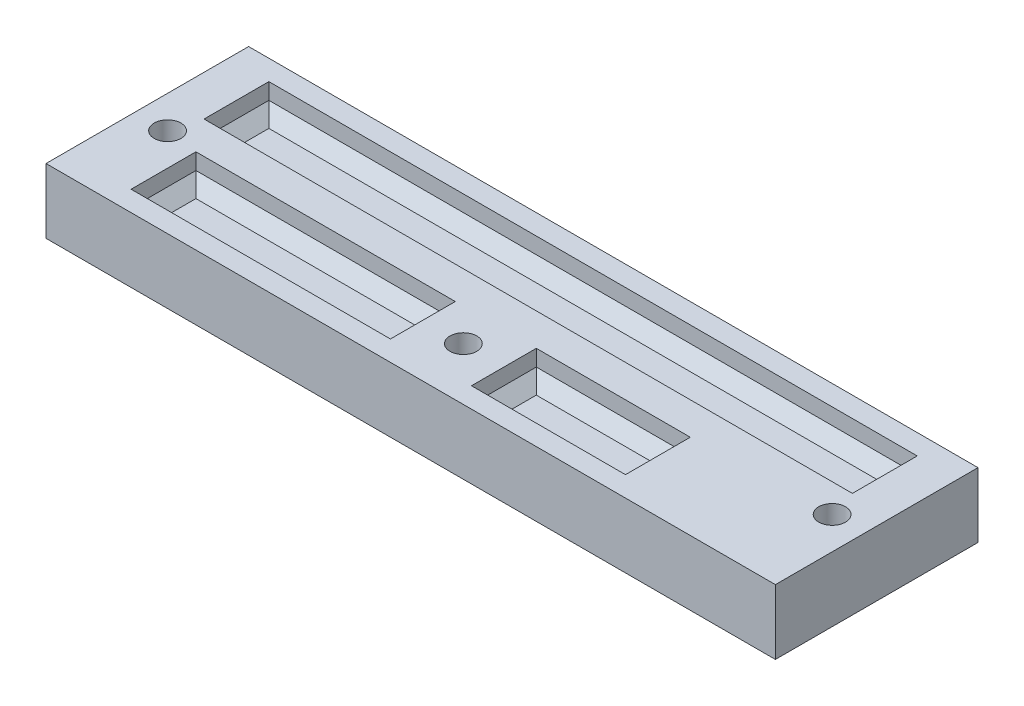
ISO-10303-21;
HEADER;
FILE_DESCRIPTION(('STEP AP214'),'2;1');
FILE_NAME('part.step','',(''),(''),'','','');
FILE_SCHEMA(('AUTOMOTIVE_DESIGN { 1 0 10303 214 1 1 1 1 }'));
ENDSEC;
DATA;
#1=APPLICATION_CONTEXT('core data for automotive mechanical design processes');
#2=APPLICATION_PROTOCOL_DEFINITION('international standard','automotive_design',2000,#1);
#3=PRODUCT_CONTEXT('',#1,'mechanical');
#4=PRODUCT('Part','Part','',(#3));
#5=PRODUCT_RELATED_PRODUCT_CATEGORY('part','',(#4));
#6=PRODUCT_DEFINITION_FORMATION('','',#4);
#7=PRODUCT_DEFINITION_CONTEXT('part definition',#1,'design');
#8=PRODUCT_DEFINITION('design','',#6,#7);
#9=PRODUCT_DEFINITION_SHAPE('','',#8);
#10=(LENGTH_UNIT() NAMED_UNIT(*) SI_UNIT(.MILLI.,.METRE.));
#11=(NAMED_UNIT(*) PLANE_ANGLE_UNIT() SI_UNIT($,.RADIAN.));
#12=(NAMED_UNIT(*) SI_UNIT($,.STERADIAN.) SOLID_ANGLE_UNIT());
#13=UNCERTAINTY_MEASURE_WITH_UNIT(LENGTH_MEASURE(1.E-05),#10,'distance_accuracy_value','');
#14=(GEOMETRIC_REPRESENTATION_CONTEXT(3) GLOBAL_UNCERTAINTY_ASSIGNED_CONTEXT((#13)) GLOBAL_UNIT_ASSIGNED_CONTEXT((#10,
#11,#12)) REPRESENTATION_CONTEXT('',''));
#15=CARTESIAN_POINT('',(0.,0.,0.));
#16=DIRECTION('',(0.,0.,1.));
#17=DIRECTION('',(1.,0.,0.));
#18=AXIS2_PLACEMENT_3D('',#15,#16,#17);
#19=CARTESIAN_POINT('',(0.,8.,0.));
#20=DIRECTION('',(0.,-1.,0.));
#21=DIRECTION('',(0.,0.,-1.));
#22=AXIS2_PLACEMENT_3D('',#19,#20,#21);
#23=PLANE('',#22);
#24=DIRECTION('',(0.,0.,-1.));
#25=VECTOR('',#24,1.);
#26=CARTESIAN_POINT('',(45.,8.,12.5));
#27=LINE('',#26,#25);
#28=CARTESIAN_POINT('',(45.,8.,12.5));
#29=VERTEX_POINT('',#28);
#30=CARTESIAN_POINT('',(45.,8.,-12.5));
#31=VERTEX_POINT('',#30);
#32=EDGE_CURVE('E366',#29,#31,#27,.T.);
#33=ORIENTED_EDGE('',*,*,#32,.T.);
#34=DIRECTION('',(-1.,0.,0.));
#35=VECTOR('',#34,1.);
#36=CARTESIAN_POINT('',(-45.,8.,-12.5));
#37=LINE('',#36,#35);
#38=CARTESIAN_POINT('',(-45.,8.,-12.5));
#39=VERTEX_POINT('',#38);
#40=EDGE_CURVE('E369',#31,#39,#37,.T.);
#41=ORIENTED_EDGE('',*,*,#40,.T.);
#42=DIRECTION('',(0.,0.,1.));
#43=VECTOR('',#42,1.);
#44=CARTESIAN_POINT('',(-45.,8.,12.5));
#45=LINE('',#44,#43);
#46=CARTESIAN_POINT('',(-45.,8.,12.5));
#47=VERTEX_POINT('',#46);
#48=EDGE_CURVE('E372',#39,#47,#45,.T.);
#49=ORIENTED_EDGE('',*,*,#48,.T.);
#50=DIRECTION('',(1.,0.,0.));
#51=VECTOR('',#50,1.);
#52=CARTESIAN_POINT('',(-45.,8.,12.5));
#53=LINE('',#52,#51);
#54=EDGE_CURVE('E374',#47,#29,#53,.T.);
#55=ORIENTED_EDGE('',*,*,#54,.T.);
#56=EDGE_LOOP('',(#33,#41,#49,#55));
#57=FACE_BOUND('',#56,.T.);
#58=CARTESIAN_POINT('',(-41.,8.,1.5));
#59=DIRECTION('',(0.,1.,0.));
#60=DIRECTION('',(0.,0.,1.));
#61=AXIS2_PLACEMENT_3D('',#58,#59,#60);
#62=CIRCLE('',#61,1.65);
#63=CARTESIAN_POINT('',(-41.,8.,3.15));
#64=VERTEX_POINT('',#63);
#65=EDGE_CURVE('E363',#64,#64,#62,.T.);
#66=ORIENTED_EDGE('',*,*,#65,.F.);
#67=EDGE_LOOP('',(#66));
#68=FACE_BOUND('',#67,.T.);
#69=CARTESIAN_POINT('',(41.,8.,1.50000000000003));
#70=DIRECTION('',(0.,1.,0.));
#71=DIRECTION('',(0.,0.,1.));
#72=AXIS2_PLACEMENT_3D('',#69,#70,#71);
#73=CIRCLE('',#72,1.65000000000002);
#74=CARTESIAN_POINT('',(41.,8.,3.15000000000005));
#75=VERTEX_POINT('',#74);
#76=EDGE_CURVE('E360',#75,#75,#73,.T.);
#77=ORIENTED_EDGE('',*,*,#76,.F.);
#78=EDGE_LOOP('',(#77));
#79=FACE_BOUND('',#78,.T.);
#80=CARTESIAN_POINT('',(0.,8.,5.99999999999998));
#81=DIRECTION('',(0.,1.,0.));
#82=DIRECTION('',(0.,0.,1.));
#83=AXIS2_PLACEMENT_3D('',#80,#81,#82);
#84=CIRCLE('',#83,1.65);
#85=CARTESIAN_POINT('',(0.,8.,7.64999999999998));
#86=VERTEX_POINT('',#85);
#87=EDGE_CURVE('E356',#86,#86,#84,.T.);
#88=ORIENTED_EDGE('',*,*,#87,.F.);
#89=EDGE_LOOP('',(#88));
#90=FACE_BOUND('',#89,.T.);
#91=DIRECTION('',(1.,0.,0.));
#92=VECTOR('',#91,1.);
#93=CARTESIAN_POINT('',(5.,8.,10.));
#94=LINE('',#93,#92);
#95=CARTESIAN_POINT('',(5.,8.,10.));
#96=VERTEX_POINT('',#95);
#97=CARTESIAN_POINT('',(24.,8.,10.));
#98=VERTEX_POINT('',#97);
#99=EDGE_CURVE('E305',#96,#98,#94,.T.);
#100=ORIENTED_EDGE('',*,*,#99,.F.);
#101=DIRECTION('',(0.,0.,-1.));
#102=VECTOR('',#101,1.);
#103=CARTESIAN_POINT('',(5.,8.,1.99999999999999));
#104=LINE('',#103,#102);
#105=CARTESIAN_POINT('',(5.,8.,1.99999999999999));
#106=VERTEX_POINT('',#105);
#107=EDGE_CURVE('E296',#96,#106,#104,.T.);
#108=ORIENTED_EDGE('',*,*,#107,.T.);
#109=DIRECTION('',(1.,0.,0.));
#110=VECTOR('',#109,1.);
#111=CARTESIAN_POINT('',(5.,8.,1.99999999999999));
#112=LINE('',#111,#110);
#113=CARTESIAN_POINT('',(24.,8.,1.99999999999999));
#114=VERTEX_POINT('',#113);
#115=EDGE_CURVE('E298',#106,#114,#112,.T.);
#116=ORIENTED_EDGE('',*,*,#115,.T.);
#117=DIRECTION('',(0.,0.,-1.));
#118=VECTOR('',#117,1.);
#119=CARTESIAN_POINT('',(24.,8.,1.99999999999999));
#120=LINE('',#119,#118);
#121=EDGE_CURVE('E294',#98,#114,#120,.T.);
#122=ORIENTED_EDGE('',*,*,#121,.F.);
#123=EDGE_LOOP('',(#100,#108,#116,#122));
#124=FACE_BOUND('',#123,.T.);
#125=DIRECTION('',(-1.,0.,0.));
#126=VECTOR('',#125,1.);
#127=CARTESIAN_POINT('',(-5.,8.,2.));
#128=LINE('',#127,#126);
#129=CARTESIAN_POINT('',(-5.,8.,2.));
#130=VERTEX_POINT('',#129);
#131=CARTESIAN_POINT('',(-37.,8.,2.));
#132=VERTEX_POINT('',#131);
#133=EDGE_CURVE('E66',#130,#132,#128,.T.);
#134=ORIENTED_EDGE('',*,*,#133,.F.);
#135=DIRECTION('',(0.,0.,1.));
#136=VECTOR('',#135,1.);
#137=CARTESIAN_POINT('',(-5.,8.,10.));
#138=LINE('',#137,#136);
#139=CARTESIAN_POINT('',(-5.,8.,10.));
#140=VERTEX_POINT('',#139);
#141=EDGE_CURVE('E840',#130,#140,#138,.T.);
#142=ORIENTED_EDGE('',*,*,#141,.T.);
#143=DIRECTION('',(-1.,0.,0.));
#144=VECTOR('',#143,1.);
#145=CARTESIAN_POINT('',(-5.,8.,10.));
#146=LINE('',#145,#144);
#147=CARTESIAN_POINT('',(-37.,8.,9.99999999999999));
#148=VERTEX_POINT('',#147);
#149=EDGE_CURVE('E219',#140,#148,#146,.T.);
#150=ORIENTED_EDGE('',*,*,#149,.T.);
#151=DIRECTION('',(0.,0.,1.));
#152=VECTOR('',#151,1.);
#153=CARTESIAN_POINT('',(-37.,8.,9.99999999999999));
#154=LINE('',#153,#152);
#155=EDGE_CURVE('E224',#132,#148,#154,.T.);
#156=ORIENTED_EDGE('',*,*,#155,.F.);
#157=EDGE_LOOP('',(#134,#142,#150,#156));
#158=FACE_BOUND('',#157,.T.);
#159=DIRECTION('',(0.,0.,1.));
#160=VECTOR('',#159,1.);
#161=CARTESIAN_POINT('',(-40.,8.,-1.99999999999999));
#162=LINE('',#161,#160);
#163=CARTESIAN_POINT('',(-40.,8.,-9.99999999999999));
#164=VERTEX_POINT('',#163);
#165=CARTESIAN_POINT('',(-40.,8.,-1.99999999999999));
#166=VERTEX_POINT('',#165);
#167=EDGE_CURVE('E251',#164,#166,#162,.T.);
#168=ORIENTED_EDGE('',*,*,#167,.F.);
#169=DIRECTION('',(1.,0.,0.));
#170=VECTOR('',#169,1.);
#171=CARTESIAN_POINT('',(-40.,8.,-9.99999999999999));
#172=LINE('',#171,#170);
#173=CARTESIAN_POINT('',(40.,8.,-9.99999999999999));
#174=VERTEX_POINT('',#173);
#175=EDGE_CURVE('E258',#164,#174,#172,.T.);
#176=ORIENTED_EDGE('',*,*,#175,.T.);
#177=DIRECTION('',(0.,0.,1.));
#178=VECTOR('',#177,1.);
#179=CARTESIAN_POINT('',(40.,8.,-1.99999999999999));
#180=LINE('',#179,#178);
#181=CARTESIAN_POINT('',(40.,8.,-1.99999999999999));
#182=VERTEX_POINT('',#181);
#183=EDGE_CURVE('E242',#174,#182,#180,.T.);
#184=ORIENTED_EDGE('',*,*,#183,.T.);
#185=DIRECTION('',(1.,0.,0.));
#186=VECTOR('',#185,1.);
#187=CARTESIAN_POINT('',(-40.,8.,-1.99999999999999));
#188=LINE('',#187,#186);
#189=EDGE_CURVE('E255',#166,#182,#188,.T.);
#190=ORIENTED_EDGE('',*,*,#189,.F.);
#191=EDGE_LOOP('',(#168,#176,#184,#190));
#192=FACE_BOUND('',#191,.T.);
#193=ADVANCED_FACE('F41',(#57,#68,#79,#90,#124,#158,#192),#23,.F.);
#194=CARTESIAN_POINT('',(-41.,0.,1.5));
#195=DIRECTION('',(0.,1.,0.));
#196=DIRECTION('',(0.,0.,1.));
#197=AXIS2_PLACEMENT_3D('',#194,#195,#196);
#198=CYLINDRICAL_SURFACE('',#197,1.65);
#199=ORIENTED_EDGE('',*,*,#65,.T.);
#200=EDGE_LOOP('',(#199));
#201=FACE_BOUND('',#200,.T.);
#202=CARTESIAN_POINT('',(-41.,4.,1.5));
#203=DIRECTION('',(0.,-1.,0.));
#204=DIRECTION('',(0.,0.,-1.));
#205=AXIS2_PLACEMENT_3D('',#202,#203,#204);
#206=CIRCLE('',#205,1.65);
#207=CARTESIAN_POINT('',(-41.,4.,-0.150000000000002));
#208=VERTEX_POINT('',#207);
#209=EDGE_CURVE('E45',#208,#208,#206,.F.);
#210=ORIENTED_EDGE('',*,*,#209,.F.);
#211=EDGE_LOOP('',(#210));
#212=FACE_BOUND('',#211,.T.);
#213=ADVANCED_FACE('F401',(#201,#212),#198,.F.);
#214=CARTESIAN_POINT('',(41.,0.,1.50000000000003));
#215=DIRECTION('',(0.,1.,0.));
#216=DIRECTION('',(0.,0.,1.));
#217=AXIS2_PLACEMENT_3D('',#214,#215,#216);
#218=CYLINDRICAL_SURFACE('',#217,1.65000000000002);
#219=ORIENTED_EDGE('',*,*,#76,.T.);
#220=EDGE_LOOP('',(#219));
#221=FACE_BOUND('',#220,.T.);
#222=CARTESIAN_POINT('',(41.,4.,1.50000000000003));
#223=DIRECTION('',(0.,-1.,0.));
#224=DIRECTION('',(0.,0.,-1.));
#225=AXIS2_PLACEMENT_3D('',#222,#223,#224);
#226=CIRCLE('',#225,1.65000000000002);
#227=CARTESIAN_POINT('',(41.,4.,-0.149999999999998));
#228=VERTEX_POINT('',#227);
#229=EDGE_CURVE('E392',#228,#228,#226,.F.);
#230=ORIENTED_EDGE('',*,*,#229,.F.);
#231=EDGE_LOOP('',(#230));
#232=FACE_BOUND('',#231,.T.);
#233=ADVANCED_FACE('F403',(#221,#232),#218,.F.);
#234=CARTESIAN_POINT('',(0.,0.,5.99999999999998));
#235=DIRECTION('',(0.,1.,0.));
#236=DIRECTION('',(0.,0.,1.));
#237=AXIS2_PLACEMENT_3D('',#234,#235,#236);
#238=CYLINDRICAL_SURFACE('',#237,1.65);
#239=ORIENTED_EDGE('',*,*,#87,.T.);
#240=EDGE_LOOP('',(#239));
#241=FACE_BOUND('',#240,.T.);
#242=CARTESIAN_POINT('',(0.,4.,5.99999999999998));
#243=DIRECTION('',(0.,-1.,0.));
#244=DIRECTION('',(0.,0.,-1.));
#245=AXIS2_PLACEMENT_3D('',#242,#243,#244);
#246=CIRCLE('',#245,1.65);
#247=CARTESIAN_POINT('',(0.,4.,4.34999999999998));
#248=VERTEX_POINT('',#247);
#249=EDGE_CURVE('E341',#248,#248,#246,.F.);
#250=ORIENTED_EDGE('',*,*,#249,.F.);
#251=EDGE_LOOP('',(#250));
#252=FACE_BOUND('',#251,.T.);
#253=ADVANCED_FACE('F410',(#241,#252),#238,.F.);
#254=CARTESIAN_POINT('',(45.,8.,12.5));
#255=DIRECTION('',(-1.,0.,0.));
#256=DIRECTION('',(0.,0.,1.));
#257=AXIS2_PLACEMENT_3D('',#254,#255,#256);
#258=PLANE('',#257);
#259=DIRECTION('',(0.,0.,-1.));
#260=VECTOR('',#259,1.);
#261=CARTESIAN_POINT('',(45.,0.,12.5));
#262=LINE('',#261,#260);
#263=CARTESIAN_POINT('',(45.,0.,12.5));
#264=VERTEX_POINT('',#263);
#265=CARTESIAN_POINT('',(45.,0.,-12.5));
#266=VERTEX_POINT('',#265);
#267=EDGE_CURVE('E359',#264,#266,#262,.T.);
#268=ORIENTED_EDGE('',*,*,#267,.T.);
#269=DIRECTION('',(0.,-1.,0.));
#270=VECTOR('',#269,1.);
#271=CARTESIAN_POINT('',(45.,8.,-12.5));
#272=LINE('',#271,#270);
#273=EDGE_CURVE('E11',#31,#266,#272,.T.);
#274=ORIENTED_EDGE('',*,*,#273,.F.);
#275=ORIENTED_EDGE('',*,*,#32,.F.);
#276=DIRECTION('',(0.,-1.,0.));
#277=VECTOR('',#276,1.);
#278=CARTESIAN_POINT('',(45.,8.,12.5));
#279=LINE('',#278,#277);
#280=EDGE_CURVE('E376',#29,#264,#279,.T.);
#281=ORIENTED_EDGE('',*,*,#280,.T.);
#282=EDGE_LOOP('',(#268,#274,#275,#281));
#283=FACE_BOUND('',#282,.T.);
#284=ADVANCED_FACE('F43',(#283),#258,.F.);
#285=CARTESIAN_POINT('',(-45.,8.,-12.5));
#286=DIRECTION('',(0.,0.,1.));
#287=DIRECTION('',(1.,0.,0.));
#288=AXIS2_PLACEMENT_3D('',#285,#286,#287);
#289=PLANE('',#288);
#290=DIRECTION('',(-1.,0.,0.));
#291=VECTOR('',#290,1.);
#292=CARTESIAN_POINT('',(-45.,0.,-12.5));
#293=LINE('',#292,#291);
#294=CARTESIAN_POINT('',(-45.,0.,-12.5));
#295=VERTEX_POINT('',#294);
#296=EDGE_CURVE('E379',#266,#295,#293,.T.);
#297=ORIENTED_EDGE('',*,*,#296,.T.);
#298=DIRECTION('',(0.,-1.,0.));
#299=VECTOR('',#298,1.);
#300=CARTESIAN_POINT('',(-45.,8.,-12.5));
#301=LINE('',#300,#299);
#302=EDGE_CURVE('E50',#39,#295,#301,.T.);
#303=ORIENTED_EDGE('',*,*,#302,.F.);
#304=ORIENTED_EDGE('',*,*,#40,.F.);
#305=ORIENTED_EDGE('',*,*,#273,.T.);
#306=EDGE_LOOP('',(#297,#303,#304,#305));
#307=FACE_BOUND('',#306,.T.);
#308=ADVANCED_FACE('F428',(#307),#289,.F.);
#309=CARTESIAN_POINT('',(-45.,8.,12.5));
#310=DIRECTION('',(1.,0.,0.));
#311=DIRECTION('',(0.,0.,-1.));
#312=AXIS2_PLACEMENT_3D('',#309,#310,#311);
#313=PLANE('',#312);
#314=DIRECTION('',(0.,0.,1.));
#315=VECTOR('',#314,1.);
#316=CARTESIAN_POINT('',(-45.,0.,12.5));
#317=LINE('',#316,#315);
#318=CARTESIAN_POINT('',(-45.,0.,12.5));
#319=VERTEX_POINT('',#318);
#320=EDGE_CURVE('E381',#295,#319,#317,.T.);
#321=ORIENTED_EDGE('',*,*,#320,.T.);
#322=DIRECTION('',(0.,-1.,0.));
#323=VECTOR('',#322,1.);
#324=CARTESIAN_POINT('',(-45.,8.,12.5));
#325=LINE('',#324,#323);
#326=EDGE_CURVE('E386',#47,#319,#325,.T.);
#327=ORIENTED_EDGE('',*,*,#326,.F.);
#328=ORIENTED_EDGE('',*,*,#48,.F.);
#329=ORIENTED_EDGE('',*,*,#302,.T.);
#330=EDGE_LOOP('',(#321,#327,#328,#329));
#331=FACE_BOUND('',#330,.T.);
#332=ADVANCED_FACE('F425',(#331),#313,.F.);
#333=CARTESIAN_POINT('',(-45.,8.,12.5));
#334=DIRECTION('',(0.,0.,-1.));
#335=DIRECTION('',(-1.,0.,0.));
#336=AXIS2_PLACEMENT_3D('',#333,#334,#335);
#337=PLANE('',#336);
#338=DIRECTION('',(1.,0.,0.));
#339=VECTOR('',#338,1.);
#340=CARTESIAN_POINT('',(-45.,0.,12.5));
#341=LINE('',#340,#339);
#342=EDGE_CURVE('E370',#319,#264,#341,.T.);
#343=ORIENTED_EDGE('',*,*,#342,.T.);
#344=ORIENTED_EDGE('',*,*,#280,.F.);
#345=ORIENTED_EDGE('',*,*,#54,.F.);
#346=ORIENTED_EDGE('',*,*,#326,.T.);
#347=EDGE_LOOP('',(#343,#344,#345,#346));
#348=FACE_BOUND('',#347,.T.);
#349=ADVANCED_FACE('F422',(#348),#337,.F.);
#350=CARTESIAN_POINT('',(0.,0.,0.));
#351=DIRECTION('',(0.,-1.,0.));
#352=DIRECTION('',(0.,0.,-1.));
#353=AXIS2_PLACEMENT_3D('',#350,#351,#352);
#354=PLANE('',#353);
#355=CARTESIAN_POINT('',(-41.,0.,1.5));
#356=DIRECTION('',(0.,-1.,0.));
#357=DIRECTION('',(0.,0.,-1.));
#358=AXIS2_PLACEMENT_3D('',#355,#356,#357);
#359=CIRCLE('',#358,3.25);
#360=CARTESIAN_POINT('',(-41.,0.,-1.75));
#361=VERTEX_POINT('',#360);
#362=EDGE_CURVE('E342',#361,#361,#359,.T.);
#363=ORIENTED_EDGE('',*,*,#362,.F.);
#364=EDGE_LOOP('',(#363));
#365=FACE_BOUND('',#364,.T.);
#366=CARTESIAN_POINT('',(41.,0.,1.50000000000003));
#367=DIRECTION('',(0.,-1.,0.));
#368=DIRECTION('',(0.,0.,-1.));
#369=AXIS2_PLACEMENT_3D('',#366,#367,#368);
#370=CIRCLE('',#369,3.25);
#371=CARTESIAN_POINT('',(41.,0.,-1.74999999999998));
#372=VERTEX_POINT('',#371);
#373=EDGE_CURVE('E345',#372,#372,#370,.T.);
#374=ORIENTED_EDGE('',*,*,#373,.F.);
#375=EDGE_LOOP('',(#374));
#376=FACE_BOUND('',#375,.T.);
#377=CARTESIAN_POINT('',(0.,0.,6.));
#378=DIRECTION('',(0.,-1.,0.));
#379=DIRECTION('',(0.,0.,-1.));
#380=AXIS2_PLACEMENT_3D('',#377,#378,#379);
#381=CIRCLE('',#380,3.25);
#382=CARTESIAN_POINT('',(0.,0.,2.75));
#383=VERTEX_POINT('',#382);
#384=EDGE_CURVE('E351',#383,#383,#381,.T.);
#385=ORIENTED_EDGE('',*,*,#384,.F.);
#386=EDGE_LOOP('',(#385));
#387=FACE_BOUND('',#386,.T.);
#388=ORIENTED_EDGE('',*,*,#267,.F.);
#389=ORIENTED_EDGE('',*,*,#342,.F.);
#390=ORIENTED_EDGE('',*,*,#320,.F.);
#391=ORIENTED_EDGE('',*,*,#296,.F.);
#392=EDGE_LOOP('',(#388,#389,#390,#391));
#393=FACE_BOUND('',#392,.T.);
#394=ADVANCED_FACE('F418',(#365,#376,#387,#393),#354,.T.);
#395=CARTESIAN_POINT('',(0.,4.,6.));
#396=DIRECTION('',(0.,-1.,0.));
#397=DIRECTION('',(0.,0.,-1.));
#398=AXIS2_PLACEMENT_3D('',#395,#396,#397);
#399=PLANE('',#398);
#400=CARTESIAN_POINT('',(0.,4.,6.));
#401=DIRECTION('',(0.,-1.,0.));
#402=DIRECTION('',(0.,0.,-1.));
#403=AXIS2_PLACEMENT_3D('',#400,#401,#402);
#404=CIRCLE('',#403,3.25);
#405=CARTESIAN_POINT('',(0.,4.,2.75));
#406=VERTEX_POINT('',#405);
#407=EDGE_CURVE('E337',#406,#406,#404,.T.);
#408=ORIENTED_EDGE('',*,*,#407,.T.);
#409=EDGE_LOOP('',(#408));
#410=FACE_BOUND('',#409,.T.);
#411=ORIENTED_EDGE('',*,*,#249,.T.);
#412=EDGE_LOOP('',(#411));
#413=FACE_BOUND('',#412,.T.);
#414=ADVANCED_FACE('F421',(#410,#413),#399,.T.);
#415=CARTESIAN_POINT('',(0.,4.,6.));
#416=DIRECTION('',(0.,-1.,0.));
#417=DIRECTION('',(0.,0.,-1.));
#418=AXIS2_PLACEMENT_3D('',#415,#416,#417);
#419=CYLINDRICAL_SURFACE('',#418,3.25);
#420=ORIENTED_EDGE('',*,*,#407,.F.);
#421=EDGE_LOOP('',(#420));
#422=FACE_BOUND('',#421,.T.);
#423=ORIENTED_EDGE('',*,*,#384,.T.);
#424=EDGE_LOOP('',(#423));
#425=FACE_BOUND('',#424,.T.);
#426=ADVANCED_FACE('F569',(#422,#425),#419,.F.);
#427=CARTESIAN_POINT('',(41.,4.,1.50000000000003));
#428=DIRECTION('',(0.,-1.,0.));
#429=DIRECTION('',(0.,0.,-1.));
#430=AXIS2_PLACEMENT_3D('',#427,#428,#429);
#431=PLANE('',#430);
#432=CARTESIAN_POINT('',(41.,4.,1.50000000000003));
#433=DIRECTION('',(0.,-1.,0.));
#434=DIRECTION('',(0.,0.,-1.));
#435=AXIS2_PLACEMENT_3D('',#432,#433,#434);
#436=CIRCLE('',#435,3.25);
#437=CARTESIAN_POINT('',(41.,4.,-1.74999999999998));
#438=VERTEX_POINT('',#437);
#439=EDGE_CURVE('E348',#438,#438,#436,.T.);
#440=ORIENTED_EDGE('',*,*,#439,.T.);
#441=EDGE_LOOP('',(#440));
#442=FACE_BOUND('',#441,.T.);
#443=ORIENTED_EDGE('',*,*,#229,.T.);
#444=EDGE_LOOP('',(#443));
#445=FACE_BOUND('',#444,.T.);
#446=ADVANCED_FACE('F565',(#442,#445),#431,.T.);
#447=CARTESIAN_POINT('',(41.,4.,1.50000000000003));
#448=DIRECTION('',(0.,-1.,0.));
#449=DIRECTION('',(0.,0.,-1.));
#450=AXIS2_PLACEMENT_3D('',#447,#448,#449);
#451=CYLINDRICAL_SURFACE('',#450,3.25);
#452=ORIENTED_EDGE('',*,*,#439,.F.);
#453=EDGE_LOOP('',(#452));
#454=FACE_BOUND('',#453,.T.);
#455=ORIENTED_EDGE('',*,*,#373,.T.);
#456=EDGE_LOOP('',(#455));
#457=FACE_BOUND('',#456,.T.);
#458=ADVANCED_FACE('F558',(#454,#457),#451,.F.);
#459=CARTESIAN_POINT('',(-41.,4.,1.5));
#460=DIRECTION('',(0.,-1.,0.));
#461=DIRECTION('',(0.,0.,-1.));
#462=AXIS2_PLACEMENT_3D('',#459,#460,#461);
#463=PLANE('',#462);
#464=CARTESIAN_POINT('',(-41.,4.,1.5));
#465=DIRECTION('',(0.,-1.,0.));
#466=DIRECTION('',(0.,0.,-1.));
#467=AXIS2_PLACEMENT_3D('',#464,#465,#466);
#468=CIRCLE('',#467,3.25);
#469=CARTESIAN_POINT('',(-41.,4.,-1.75));
#470=VERTEX_POINT('',#469);
#471=EDGE_CURVE('E338',#470,#470,#468,.T.);
#472=ORIENTED_EDGE('',*,*,#471,.T.);
#473=EDGE_LOOP('',(#472));
#474=FACE_BOUND('',#473,.T.);
#475=ORIENTED_EDGE('',*,*,#209,.T.);
#476=EDGE_LOOP('',(#475));
#477=FACE_BOUND('',#476,.T.);
#478=ADVANCED_FACE('F399',(#474,#477),#463,.T.);
#479=CARTESIAN_POINT('',(-41.,4.,1.5));
#480=DIRECTION('',(0.,-1.,0.));
#481=DIRECTION('',(0.,0.,-1.));
#482=AXIS2_PLACEMENT_3D('',#479,#480,#481);
#483=CYLINDRICAL_SURFACE('',#482,3.25);
#484=ORIENTED_EDGE('',*,*,#471,.F.);
#485=EDGE_LOOP('',(#484));
#486=FACE_BOUND('',#485,.T.);
#487=ORIENTED_EDGE('',*,*,#362,.T.);
#488=EDGE_LOOP('',(#487));
#489=FACE_BOUND('',#488,.T.);
#490=ADVANCED_FACE('F542',(#486,#489),#483,.F.);
#491=CARTESIAN_POINT('',(5.,6.,1.99999999999999));
#492=DIRECTION('',(0.,0.,1.));
#493=DIRECTION('',(1.,0.,0.));
#494=AXIS2_PLACEMENT_3D('',#491,#492,#493);
#495=PLANE('',#494);
#496=DIRECTION('',(0.,-1.,0.));
#497=VECTOR('',#496,1.);
#498=CARTESIAN_POINT('',(24.,6.,1.99999999999999));
#499=LINE('',#498,#497);
#500=CARTESIAN_POINT('',(24.,6.,1.99999999999999));
#501=VERTEX_POINT('',#500);
#502=EDGE_CURVE('E232',#114,#501,#499,.T.);
#503=ORIENTED_EDGE('',*,*,#502,.F.);
#504=ORIENTED_EDGE('',*,*,#115,.F.);
#505=DIRECTION('',(0.,-1.,0.));
#506=VECTOR('',#505,1.);
#507=CARTESIAN_POINT('',(5.,6.,1.99999999999999));
#508=LINE('',#507,#506);
#509=CARTESIAN_POINT('',(5.,6.,1.99999999999999));
#510=VERTEX_POINT('',#509);
#511=EDGE_CURVE('E290',#106,#510,#508,.T.);
#512=ORIENTED_EDGE('',*,*,#511,.T.);
#513=DIRECTION('',(1.,0.,0.));
#514=VECTOR('',#513,1.);
#515=CARTESIAN_POINT('',(5.,6.,1.99999999999999));
#516=LINE('',#515,#514);
#517=EDGE_CURVE('E316',#510,#501,#516,.T.);
#518=ORIENTED_EDGE('',*,*,#517,.T.);
#519=EDGE_LOOP('',(#503,#504,#512,#518));
#520=FACE_BOUND('',#519,.T.);
#521=ADVANCED_FACE('F538',(#520),#495,.T.);
#522=CARTESIAN_POINT('',(5.,4.5,3.49999999999999));
#523=DIRECTION('',(0.,0.707106781186548,0.707106781186547));
#524=DIRECTION('',(0.,0.707106781186547,-0.707106781186548));
#525=AXIS2_PLACEMENT_3D('',#522,#523,#524);
#526=PLANE('',#525);
#527=ORIENTED_EDGE('',*,*,#517,.F.);
#528=DIRECTION('',(0.577350269189627,-0.577350269189625,0.577350269189626));
#529=VECTOR('',#528,1.);
#530=CARTESIAN_POINT('',(6.33333333333334,4.66666666666667,3.33333333333333));
#531=LINE('',#530,#529);
#532=CARTESIAN_POINT('',(6.5,4.5,3.49999999999999));
#533=VERTEX_POINT('',#532);
#534=EDGE_CURVE('E330',#533,#510,#531,.F.);
#535=ORIENTED_EDGE('',*,*,#534,.F.);
#536=DIRECTION('',(1.,0.,0.));
#537=VECTOR('',#536,1.);
#538=CARTESIAN_POINT('',(5.,4.5,3.49999999999999));
#539=LINE('',#538,#537);
#540=CARTESIAN_POINT('',(22.5,4.5,3.5));
#541=VERTEX_POINT('',#540);
#542=EDGE_CURVE('E313',#533,#541,#539,.T.);
#543=ORIENTED_EDGE('',*,*,#542,.T.);
#544=DIRECTION('',(-0.577350269189624,-0.577350269189626,0.577350269189627));
#545=VECTOR('',#544,1.);
#546=CARTESIAN_POINT('',(20.8333333333333,2.83333333333333,5.16666666666667));
#547=LINE('',#546,#545);
#548=EDGE_CURVE('E332',#501,#541,#547,.T.);
#549=ORIENTED_EDGE('',*,*,#548,.F.);
#550=EDGE_LOOP('',(#527,#535,#543,#549));
#551=FACE_BOUND('',#550,.T.);
#552=ADVANCED_FACE('F534',(#551),#526,.T.);
#553=CARTESIAN_POINT('',(5.,4.5,8.5));
#554=DIRECTION('',(0.,1.,0.));
#555=DIRECTION('',(0.,0.,-1.));
#556=AXIS2_PLACEMENT_3D('',#553,#554,#555);
#557=PLANE('',#556);
#558=ORIENTED_EDGE('',*,*,#542,.F.);
#559=DIRECTION('',(0.,0.,-1.));
#560=VECTOR('',#559,1.);
#561=CARTESIAN_POINT('',(6.5,4.5,8.5));
#562=LINE('',#561,#560);
#563=CARTESIAN_POINT('',(6.5,4.5,8.5));
#564=VERTEX_POINT('',#563);
#565=EDGE_CURVE('E319',#564,#533,#562,.T.);
#566=ORIENTED_EDGE('',*,*,#565,.F.);
#567=DIRECTION('',(1.,0.,0.));
#568=VECTOR('',#567,1.);
#569=CARTESIAN_POINT('',(5.,4.5,8.5));
#570=LINE('',#569,#568);
#571=CARTESIAN_POINT('',(22.5,4.5,8.5));
#572=VERTEX_POINT('',#571);
#573=EDGE_CURVE('E310',#564,#572,#570,.T.);
#574=ORIENTED_EDGE('',*,*,#573,.T.);
#575=DIRECTION('',(0.,0.,1.));
#576=VECTOR('',#575,1.);
#577=CARTESIAN_POINT('',(22.5,4.5,8.5));
#578=LINE('',#577,#576);
#579=EDGE_CURVE('E321',#541,#572,#578,.T.);
#580=ORIENTED_EDGE('',*,*,#579,.F.);
#581=EDGE_LOOP('',(#558,#566,#574,#580));
#582=FACE_BOUND('',#581,.T.);
#583=ADVANCED_FACE('F530',(#582),#557,.T.);
#584=CARTESIAN_POINT('',(5.,6.,10.));
#585=DIRECTION('',(0.,0.707106781186548,-0.707106781186547));
#586=DIRECTION('',(0.,-0.707106781186547,-0.707106781186548));
#587=AXIS2_PLACEMENT_3D('',#584,#585,#586);
#588=PLANE('',#587);
#589=ORIENTED_EDGE('',*,*,#573,.F.);
#590=DIRECTION('',(-0.577350269189627,0.577350269189625,0.577350269189625));
#591=VECTOR('',#590,1.);
#592=CARTESIAN_POINT('',(6.33333333333334,4.66666666666667,8.66666666666666));
#593=LINE('',#592,#591);
#594=CARTESIAN_POINT('',(5.,6.,10.));
#595=VERTEX_POINT('',#594);
#596=EDGE_CURVE('E324',#595,#564,#593,.F.);
#597=ORIENTED_EDGE('',*,*,#596,.F.);
#598=DIRECTION('',(1.,0.,0.));
#599=VECTOR('',#598,1.);
#600=CARTESIAN_POINT('',(5.,6.,10.));
#601=LINE('',#600,#599);
#602=CARTESIAN_POINT('',(24.,6.,10.));
#603=VERTEX_POINT('',#602);
#604=EDGE_CURVE('E307',#595,#603,#601,.T.);
#605=ORIENTED_EDGE('',*,*,#604,.T.);
#606=DIRECTION('',(0.577350269189624,0.577350269189627,0.577350269189627));
#607=VECTOR('',#606,1.);
#608=CARTESIAN_POINT('',(22.5,4.5,8.5));
#609=LINE('',#608,#607);
#610=EDGE_CURVE('E326',#572,#603,#609,.T.);
#611=ORIENTED_EDGE('',*,*,#610,.F.);
#612=EDGE_LOOP('',(#589,#597,#605,#611));
#613=FACE_BOUND('',#612,.T.);
#614=ADVANCED_FACE('F526',(#613),#588,.T.);
#615=CARTESIAN_POINT('',(5.,8.,10.));
#616=DIRECTION('',(0.,0.,-1.));
#617=DIRECTION('',(-1.,0.,0.));
#618=AXIS2_PLACEMENT_3D('',#615,#616,#617);
#619=PLANE('',#618);
#620=DIRECTION('',(0.,1.,0.));
#621=VECTOR('',#620,1.);
#622=CARTESIAN_POINT('',(24.,8.,10.));
#623=LINE('',#622,#621);
#624=EDGE_CURVE('E235',#603,#98,#623,.T.);
#625=ORIENTED_EDGE('',*,*,#624,.F.);
#626=ORIENTED_EDGE('',*,*,#604,.F.);
#627=DIRECTION('',(0.,1.,0.));
#628=VECTOR('',#627,1.);
#629=CARTESIAN_POINT('',(5.,8.,10.));
#630=LINE('',#629,#628);
#631=EDGE_CURVE('E293',#595,#96,#630,.T.);
#632=ORIENTED_EDGE('',*,*,#631,.T.);
#633=ORIENTED_EDGE('',*,*,#99,.T.);
#634=EDGE_LOOP('',(#625,#626,#632,#633));
#635=FACE_BOUND('',#634,.T.);
#636=ADVANCED_FACE('F518',(#635),#619,.T.);
#637=CARTESIAN_POINT('',(5.,8.,5.99999999999999));
#638=DIRECTION('',(1.,0.,0.));
#639=DIRECTION('',(0.,0.,-1.));
#640=AXIS2_PLACEMENT_3D('',#637,#638,#639);
#641=PLANE('',#640);
#642=ORIENTED_EDGE('',*,*,#511,.F.);
#643=ORIENTED_EDGE('',*,*,#107,.F.);
#644=ORIENTED_EDGE('',*,*,#631,.F.);
#645=DIRECTION('',(0.,0.,1.));
#646=VECTOR('',#645,1.);
#647=CARTESIAN_POINT('',(5.,6.,5.99999999999999));
#648=LINE('',#647,#646);
#649=EDGE_CURVE('E334',#510,#595,#648,.T.);
#650=ORIENTED_EDGE('',*,*,#649,.F.);
#651=EDGE_LOOP('',(#642,#643,#644,#650));
#652=FACE_BOUND('',#651,.T.);
#653=ADVANCED_FACE('F514',(#652),#641,.T.);
#654=CARTESIAN_POINT('',(24.,8.,6.));
#655=DIRECTION('',(1.,0.,0.));
#656=DIRECTION('',(0.,0.,-1.));
#657=AXIS2_PLACEMENT_3D('',#654,#655,#656);
#658=PLANE('',#657);
#659=ORIENTED_EDGE('',*,*,#624,.T.);
#660=ORIENTED_EDGE('',*,*,#121,.T.);
#661=ORIENTED_EDGE('',*,*,#502,.T.);
#662=DIRECTION('',(0.,0.,-1.));
#663=VECTOR('',#662,1.);
#664=CARTESIAN_POINT('',(24.,6.,3.5));
#665=LINE('',#664,#663);
#666=EDGE_CURVE('E328',#603,#501,#665,.T.);
#667=ORIENTED_EDGE('',*,*,#666,.F.);
#668=EDGE_LOOP('',(#659,#660,#661,#667));
#669=FACE_BOUND('',#668,.T.);
#670=ADVANCED_FACE('F517',(#669),#658,.F.);
#671=CARTESIAN_POINT('',(22.5,4.5,8.5));
#672=DIRECTION('',(0.707106781186549,-0.707106781186546,0.));
#673=DIRECTION('',(0.,0.,-1.));
#674=AXIS2_PLACEMENT_3D('',#671,#672,#673);
#675=PLANE('',#674);
#676=ORIENTED_EDGE('',*,*,#548,.T.);
#677=ORIENTED_EDGE('',*,*,#579,.T.);
#678=ORIENTED_EDGE('',*,*,#610,.T.);
#679=ORIENTED_EDGE('',*,*,#666,.T.);
#680=EDGE_LOOP('',(#676,#677,#678,#679));
#681=FACE_BOUND('',#680,.T.);
#682=ADVANCED_FACE('F522',(#681),#675,.F.);
#683=CARTESIAN_POINT('',(5.,6.,5.99999999999999));
#684=DIRECTION('',(0.707106781186547,0.707106781186548,0.));
#685=DIRECTION('',(0.,0.,1.));
#686=AXIS2_PLACEMENT_3D('',#683,#684,#685);
#687=PLANE('',#686);
#688=ORIENTED_EDGE('',*,*,#534,.T.);
#689=ORIENTED_EDGE('',*,*,#649,.T.);
#690=ORIENTED_EDGE('',*,*,#596,.T.);
#691=ORIENTED_EDGE('',*,*,#565,.T.);
#692=EDGE_LOOP('',(#688,#689,#690,#691));
#693=FACE_BOUND('',#692,.T.);
#694=ADVANCED_FACE('F549',(#693),#687,.T.);
#695=CARTESIAN_POINT('',(-5.,6.,10.));
#696=DIRECTION('',(0.,0.,-1.));
#697=DIRECTION('',(-1.,0.,0.));
#698=AXIS2_PLACEMENT_3D('',#695,#696,#697);
#699=PLANE('',#698);
#700=DIRECTION('',(0.,-1.,0.));
#701=VECTOR('',#700,1.);
#702=CARTESIAN_POINT('',(-37.,6.,9.99999999999999));
#703=LINE('',#702,#701);
#704=CARTESIAN_POINT('',(-37.,6.,9.99999999999999));
#705=VERTEX_POINT('',#704);
#706=EDGE_CURVE('E289',#148,#705,#703,.T.);
#707=ORIENTED_EDGE('',*,*,#706,.F.);
#708=ORIENTED_EDGE('',*,*,#149,.F.);
#709=DIRECTION('',(0.,-1.,0.));
#710=VECTOR('',#709,1.);
#711=CARTESIAN_POINT('',(-5.,6.,10.));
#712=LINE('',#711,#710);
#713=CARTESIAN_POINT('',(-5.,6.,10.));
#714=VERTEX_POINT('',#713);
#715=EDGE_CURVE('E213',#140,#714,#712,.T.);
#716=ORIENTED_EDGE('',*,*,#715,.T.);
#717=DIRECTION('',(-1.,0.,0.));
#718=VECTOR('',#717,1.);
#719=CARTESIAN_POINT('',(-5.,6.,10.));
#720=LINE('',#719,#718);
#721=EDGE_CURVE('E216',#714,#705,#720,.T.);
#722=ORIENTED_EDGE('',*,*,#721,.T.);
#723=EDGE_LOOP('',(#707,#708,#716,#722));
#724=FACE_BOUND('',#723,.T.);
#725=ADVANCED_FACE('F215',(#724),#699,.T.);
#726=CARTESIAN_POINT('',(-5.,4.5,8.5));
#727=DIRECTION('',(0.,0.707106781186548,-0.707106781186547));
#728=DIRECTION('',(0.,0.707106781186547,0.707106781186548));
#729=AXIS2_PLACEMENT_3D('',#726,#727,#728);
#730=PLANE('',#729);
#731=ORIENTED_EDGE('',*,*,#721,.F.);
#732=DIRECTION('',(-0.577350269189627,-0.577350269189625,-0.577350269189626));
#733=VECTOR('',#732,1.);
#734=CARTESIAN_POINT('',(-6.33333333333334,4.66666666666667,8.66666666666667));
#735=LINE('',#734,#733);
#736=CARTESIAN_POINT('',(-6.50000000000001,4.5,8.5));
#737=VERTEX_POINT('',#736);
#738=EDGE_CURVE('E195',#737,#714,#735,.F.);
#739=ORIENTED_EDGE('',*,*,#738,.F.);
#740=DIRECTION('',(-1.,0.,0.));
#741=VECTOR('',#740,1.);
#742=CARTESIAN_POINT('',(-5.,4.5,8.5));
#743=LINE('',#742,#741);
#744=CARTESIAN_POINT('',(-35.5,4.5,8.49999999999999));
#745=VERTEX_POINT('',#744);
#746=EDGE_CURVE('E228',#737,#745,#743,.T.);
#747=ORIENTED_EDGE('',*,*,#746,.T.);
#748=DIRECTION('',(0.577350269189624,-0.577350269189626,-0.577350269189627));
#749=VECTOR('',#748,1.);
#750=CARTESIAN_POINT('',(-33.8333333333333,2.83333333333333,6.83333333333332));
#751=LINE('',#750,#749);
#752=EDGE_CURVE('E207',#705,#745,#751,.T.);
#753=ORIENTED_EDGE('',*,*,#752,.F.);
#754=EDGE_LOOP('',(#731,#739,#747,#753));
#755=FACE_BOUND('',#754,.T.);
#756=ADVANCED_FACE('F227',(#755),#730,.T.);
#757=CARTESIAN_POINT('',(-5.,4.5,3.5));
#758=DIRECTION('',(0.,1.,0.));
#759=DIRECTION('',(1.,0.,0.));
#760=AXIS2_PLACEMENT_3D('',#757,#758,#759);
#761=PLANE('',#760);
#762=ORIENTED_EDGE('',*,*,#746,.F.);
#763=DIRECTION('',(0.,0.,1.));
#764=VECTOR('',#763,1.);
#765=CARTESIAN_POINT('',(-6.50000000000001,4.5,3.5));
#766=LINE('',#765,#764);
#767=CARTESIAN_POINT('',(-6.50000000000001,4.5,3.5));
#768=VERTEX_POINT('',#767);
#769=EDGE_CURVE('E202',#768,#737,#766,.T.);
#770=ORIENTED_EDGE('',*,*,#769,.F.);
#771=DIRECTION('',(-1.,0.,0.));
#772=VECTOR('',#771,1.);
#773=CARTESIAN_POINT('',(-5.,4.5,3.5));
#774=LINE('',#773,#772);
#775=CARTESIAN_POINT('',(-35.5,4.5,3.5));
#776=VERTEX_POINT('',#775);
#777=EDGE_CURVE('E823',#768,#776,#774,.T.);
#778=ORIENTED_EDGE('',*,*,#777,.T.);
#779=DIRECTION('',(0.,0.,-1.));
#780=VECTOR('',#779,1.);
#781=CARTESIAN_POINT('',(-35.5,4.5,3.5));
#782=LINE('',#781,#780);
#783=EDGE_CURVE('E820',#745,#776,#782,.T.);
#784=ORIENTED_EDGE('',*,*,#783,.F.);
#785=EDGE_LOOP('',(#762,#770,#778,#784));
#786=FACE_BOUND('',#785,.T.);
#787=ADVANCED_FACE('F685',(#786),#761,.T.);
#788=CARTESIAN_POINT('',(-5.,6.,2.));
#789=DIRECTION('',(0.,0.707106781186548,0.707106781186547));
#790=DIRECTION('',(0.,-0.707106781186547,0.707106781186548));
#791=AXIS2_PLACEMENT_3D('',#788,#789,#790);
#792=PLANE('',#791);
#793=ORIENTED_EDGE('',*,*,#777,.F.);
#794=DIRECTION('',(0.577350269189628,0.577350269189625,-0.577350269189625));
#795=VECTOR('',#794,1.);
#796=CARTESIAN_POINT('',(-6.33333333333333,4.66666666666667,3.33333333333333));
#797=LINE('',#796,#795);
#798=CARTESIAN_POINT('',(-5.,6.,2.));
#799=VERTEX_POINT('',#798);
#800=EDGE_CURVE('E826',#799,#768,#797,.F.);
#801=ORIENTED_EDGE('',*,*,#800,.F.);
#802=DIRECTION('',(-1.,0.,0.));
#803=VECTOR('',#802,1.);
#804=CARTESIAN_POINT('',(-5.,6.,2.));
#805=LINE('',#804,#803);
#806=CARTESIAN_POINT('',(-37.,6.,2.));
#807=VERTEX_POINT('',#806);
#808=EDGE_CURVE('E834',#799,#807,#805,.T.);
#809=ORIENTED_EDGE('',*,*,#808,.T.);
#810=DIRECTION('',(-0.577350269189624,0.577350269189627,-0.577350269189627));
#811=VECTOR('',#810,1.);
#812=CARTESIAN_POINT('',(-35.5,4.5,3.5));
#813=LINE('',#812,#811);
#814=EDGE_CURVE('E828',#776,#807,#813,.T.);
#815=ORIENTED_EDGE('',*,*,#814,.F.);
#816=EDGE_LOOP('',(#793,#801,#809,#815));
#817=FACE_BOUND('',#816,.T.);
#818=ADVANCED_FACE('F693',(#817),#792,.T.);
#819=CARTESIAN_POINT('',(-5.,8.,2.));
#820=DIRECTION('',(0.,0.,1.));
#821=DIRECTION('',(1.,0.,0.));
#822=AXIS2_PLACEMENT_3D('',#819,#820,#821);
#823=PLANE('',#822);
#824=DIRECTION('',(0.,1.,0.));
#825=VECTOR('',#824,1.);
#826=CARTESIAN_POINT('',(-37.,8.,2.));
#827=LINE('',#826,#825);
#828=EDGE_CURVE('E836',#807,#132,#827,.T.);
#829=ORIENTED_EDGE('',*,*,#828,.F.);
#830=ORIENTED_EDGE('',*,*,#808,.F.);
#831=DIRECTION('',(0.,1.,0.));
#832=VECTOR('',#831,1.);
#833=CARTESIAN_POINT('',(-5.,8.,2.));
#834=LINE('',#833,#832);
#835=EDGE_CURVE('E223',#799,#130,#834,.T.);
#836=ORIENTED_EDGE('',*,*,#835,.T.);
#837=ORIENTED_EDGE('',*,*,#133,.T.);
#838=EDGE_LOOP('',(#829,#830,#836,#837));
#839=FACE_BOUND('',#838,.T.);
#840=ADVANCED_FACE('F702',(#839),#823,.T.);
#841=CARTESIAN_POINT('',(-5.,8.,6.));
#842=DIRECTION('',(-1.,0.,0.));
#843=DIRECTION('',(0.,0.,1.));
#844=AXIS2_PLACEMENT_3D('',#841,#842,#843);
#845=PLANE('',#844);
#846=ORIENTED_EDGE('',*,*,#715,.F.);
#847=ORIENTED_EDGE('',*,*,#141,.F.);
#848=ORIENTED_EDGE('',*,*,#835,.F.);
#849=DIRECTION('',(0.,0.,-1.));
#850=VECTOR('',#849,1.);
#851=CARTESIAN_POINT('',(-5.,6.,6.));
#852=LINE('',#851,#850);
#853=EDGE_CURVE('E199',#714,#799,#852,.T.);
#854=ORIENTED_EDGE('',*,*,#853,.F.);
#855=EDGE_LOOP('',(#846,#847,#848,#854));
#856=FACE_BOUND('',#855,.T.);
#857=ADVANCED_FACE('F231',(#856),#845,.T.);
#858=CARTESIAN_POINT('',(-37.,8.,5.99999999999999));
#859=DIRECTION('',(-1.,0.,0.));
#860=DIRECTION('',(0.,0.,1.));
#861=AXIS2_PLACEMENT_3D('',#858,#859,#860);
#862=PLANE('',#861);
#863=ORIENTED_EDGE('',*,*,#828,.T.);
#864=ORIENTED_EDGE('',*,*,#155,.T.);
#865=ORIENTED_EDGE('',*,*,#706,.T.);
#866=DIRECTION('',(0.,0.,1.));
#867=VECTOR('',#866,1.);
#868=CARTESIAN_POINT('',(-37.,6.00000000000001,8.49999999999999));
#869=LINE('',#868,#867);
#870=EDGE_CURVE('E208',#807,#705,#869,.T.);
#871=ORIENTED_EDGE('',*,*,#870,.F.);
#872=EDGE_LOOP('',(#863,#864,#865,#871));
#873=FACE_BOUND('',#872,.T.);
#874=ADVANCED_FACE('F718',(#873),#862,.F.);
#875=CARTESIAN_POINT('',(-35.5,4.5,3.5));
#876=DIRECTION('',(-0.707106781186549,-0.707106781186546,0.));
#877=DIRECTION('',(0.,0.,1.));
#878=AXIS2_PLACEMENT_3D('',#875,#876,#877);
#879=PLANE('',#878);
#880=ORIENTED_EDGE('',*,*,#752,.T.);
#881=ORIENTED_EDGE('',*,*,#783,.T.);
#882=ORIENTED_EDGE('',*,*,#814,.T.);
#883=ORIENTED_EDGE('',*,*,#870,.T.);
#884=EDGE_LOOP('',(#880,#881,#882,#883));
#885=FACE_BOUND('',#884,.T.);
#886=ADVANCED_FACE('F726',(#885),#879,.F.);
#887=CARTESIAN_POINT('',(-5.,6.,6.));
#888=DIRECTION('',(-0.707106781186546,0.707106781186549,0.));
#889=DIRECTION('',(0.,0.,-1.));
#890=AXIS2_PLACEMENT_3D('',#887,#888,#889);
#891=PLANE('',#890);
#892=ORIENTED_EDGE('',*,*,#738,.T.);
#893=ORIENTED_EDGE('',*,*,#853,.T.);
#894=ORIENTED_EDGE('',*,*,#800,.T.);
#895=ORIENTED_EDGE('',*,*,#769,.T.);
#896=EDGE_LOOP('',(#892,#893,#894,#895));
#897=FACE_BOUND('',#896,.T.);
#898=ADVANCED_FACE('F197',(#897),#891,.T.);
#899=CARTESIAN_POINT('',(-40.,6.,-1.99999999999999));
#900=DIRECTION('',(0.,0.,1.));
#901=DIRECTION('',(1.,0.,0.));
#902=AXIS2_PLACEMENT_3D('',#899,#900,#901);
#903=PLANE('',#902);
#904=DIRECTION('',(1.,0.,0.));
#905=VECTOR('',#904,1.);
#906=CARTESIAN_POINT('',(-40.,6.,-1.99999999999999));
#907=LINE('',#906,#905);
#908=CARTESIAN_POINT('',(-40.,6.,-1.99999999999999));
#909=VERTEX_POINT('',#908);
#910=CARTESIAN_POINT('',(40.,6.,-1.99999999999999));
#911=VERTEX_POINT('',#910);
#912=EDGE_CURVE('E254',#909,#911,#907,.T.);
#913=ORIENTED_EDGE('',*,*,#912,.F.);
#914=DIRECTION('',(0.,-1.,0.));
#915=VECTOR('',#914,1.);
#916=CARTESIAN_POINT('',(-40.,6.,-1.99999999999999));
#917=LINE('',#916,#915);
#918=EDGE_CURVE('E245',#166,#909,#917,.T.);
#919=ORIENTED_EDGE('',*,*,#918,.F.);
#920=ORIENTED_EDGE('',*,*,#189,.T.);
#921=DIRECTION('',(0.,-1.,0.));
#922=VECTOR('',#921,1.);
#923=CARTESIAN_POINT('',(40.,6.,-1.99999999999999));
#924=LINE('',#923,#922);
#925=EDGE_CURVE('E58',#182,#911,#924,.T.);
#926=ORIENTED_EDGE('',*,*,#925,.T.);
#927=EDGE_LOOP('',(#913,#919,#920,#926));
#928=FACE_BOUND('',#927,.T.);
#929=ADVANCED_FACE('F490',(#928),#903,.F.);
#930=CARTESIAN_POINT('',(-40.,8.,-9.99999999999999));
#931=DIRECTION('',(0.,0.,-1.));
#932=DIRECTION('',(-1.,0.,0.));
#933=AXIS2_PLACEMENT_3D('',#930,#931,#932);
#934=PLANE('',#933);
#935=ORIENTED_EDGE('',*,*,#175,.F.);
#936=DIRECTION('',(0.,1.,0.));
#937=VECTOR('',#936,1.);
#938=CARTESIAN_POINT('',(-40.,8.,-9.99999999999999));
#939=LINE('',#938,#937);
#940=CARTESIAN_POINT('',(-40.,6.,-9.99999999999999));
#941=VERTEX_POINT('',#940);
#942=EDGE_CURVE('E248',#941,#164,#939,.T.);
#943=ORIENTED_EDGE('',*,*,#942,.F.);
#944=DIRECTION('',(1.,0.,0.));
#945=VECTOR('',#944,1.);
#946=CARTESIAN_POINT('',(-40.,6.,-9.99999999999999));
#947=LINE('',#946,#945);
#948=CARTESIAN_POINT('',(40.,6.,-9.99999999999999));
#949=VERTEX_POINT('',#948);
#950=EDGE_CURVE('E261',#941,#949,#947,.T.);
#951=ORIENTED_EDGE('',*,*,#950,.T.);
#952=DIRECTION('',(0.,1.,0.));
#953=VECTOR('',#952,1.);
#954=CARTESIAN_POINT('',(40.,8.,-9.99999999999999));
#955=LINE('',#954,#953);
#956=EDGE_CURVE('E240',#949,#174,#955,.T.);
#957=ORIENTED_EDGE('',*,*,#956,.T.);
#958=EDGE_LOOP('',(#935,#943,#951,#957));
#959=FACE_BOUND('',#958,.T.);
#960=ADVANCED_FACE('F467',(#959),#934,.F.);
#961=CARTESIAN_POINT('',(-40.,6.,-9.99999999999999));
#962=DIRECTION('',(0.,-0.707106781186548,-0.707106781186547));
#963=DIRECTION('',(0.,0.707106781186547,-0.707106781186548));
#964=AXIS2_PLACEMENT_3D('',#961,#962,#963);
#965=PLANE('',#964);
#966=ORIENTED_EDGE('',*,*,#950,.F.);
#967=DIRECTION('',(0.577350269189624,-0.577350269189627,0.577350269189627));
#968=VECTOR('',#967,1.);
#969=CARTESIAN_POINT('',(-40.,6.,-10.));
#970=LINE('',#969,#968);
#971=CARTESIAN_POINT('',(-38.5,4.5,-8.49999999999999));
#972=VERTEX_POINT('',#971);
#973=EDGE_CURVE('E274',#972,#941,#970,.F.);
#974=ORIENTED_EDGE('',*,*,#973,.F.);
#975=DIRECTION('',(1.,0.,0.));
#976=VECTOR('',#975,1.);
#977=CARTESIAN_POINT('',(-40.,4.5,-8.49999999999999));
#978=LINE('',#977,#976);
#979=CARTESIAN_POINT('',(38.5,4.5,-8.49999999999999));
#980=VERTEX_POINT('',#979);
#981=EDGE_CURVE('E264',#972,#980,#978,.T.);
#982=ORIENTED_EDGE('',*,*,#981,.T.);
#983=DIRECTION('',(-0.57735026918963,-0.577350269189624,0.577350269189624));
#984=VECTOR('',#983,1.);
#985=CARTESIAN_POINT('',(13.333333333333,-20.6666666666667,16.6666666666668));
#986=LINE('',#985,#984);
#987=EDGE_CURVE('E276',#949,#980,#986,.T.);
#988=ORIENTED_EDGE('',*,*,#987,.F.);
#989=EDGE_LOOP('',(#966,#974,#982,#988));
#990=FACE_BOUND('',#989,.T.);
#991=ADVANCED_FACE('F489',(#990),#965,.F.);
#992=CARTESIAN_POINT('',(-40.,4.5,-8.49999999999999));
#993=DIRECTION('',(0.,-1.,0.));
#994=DIRECTION('',(0.,0.,-1.));
#995=AXIS2_PLACEMENT_3D('',#992,#993,#994);
#996=PLANE('',#995);
#997=ORIENTED_EDGE('',*,*,#981,.F.);
#998=DIRECTION('',(0.,0.,-1.));
#999=VECTOR('',#998,1.);
#1000=CARTESIAN_POINT('',(-38.5,4.5,-8.49999999999999));
#1001=LINE('',#1000,#999);
#1002=CARTESIAN_POINT('',(-38.5,4.5,-3.5));
#1003=VERTEX_POINT('',#1002);
#1004=EDGE_CURVE('E278',#1003,#972,#1001,.T.);
#1005=ORIENTED_EDGE('',*,*,#1004,.F.);
#1006=DIRECTION('',(1.,0.,0.));
#1007=VECTOR('',#1006,1.);
#1008=CARTESIAN_POINT('',(-40.,4.5,-3.5));
#1009=LINE('',#1008,#1007);
#1010=CARTESIAN_POINT('',(38.5,4.5,-3.5));
#1011=VERTEX_POINT('',#1010);
#1012=EDGE_CURVE('E267',#1003,#1011,#1009,.T.);
#1013=ORIENTED_EDGE('',*,*,#1012,.T.);
#1014=DIRECTION('',(0.,0.,1.));
#1015=VECTOR('',#1014,1.);
#1016=CARTESIAN_POINT('',(38.5,4.5,-3.5));
#1017=LINE('',#1016,#1015);
#1018=EDGE_CURVE('E281',#980,#1011,#1017,.T.);
#1019=ORIENTED_EDGE('',*,*,#1018,.F.);
#1020=EDGE_LOOP('',(#997,#1005,#1013,#1019));
#1021=FACE_BOUND('',#1020,.T.);
#1022=ADVANCED_FACE('F493',(#1021),#996,.F.);
#1023=CARTESIAN_POINT('',(-40.,4.5,-3.5));
#1024=DIRECTION('',(0.,-0.707106781186548,0.707106781186547));
#1025=DIRECTION('',(0.,-0.707106781186547,-0.707106781186548));
#1026=AXIS2_PLACEMENT_3D('',#1023,#1024,#1025);
#1027=PLANE('',#1026);
#1028=ORIENTED_EDGE('',*,*,#1012,.F.);
#1029=DIRECTION('',(-0.577350269189624,0.577350269189627,0.577350269189627));
#1030=VECTOR('',#1029,1.);
#1031=CARTESIAN_POINT('',(-39.,5.,-3.));
#1032=LINE('',#1031,#1030);
#1033=EDGE_CURVE('E283',#909,#1003,#1032,.F.);
#1034=ORIENTED_EDGE('',*,*,#1033,.F.);
#1035=ORIENTED_EDGE('',*,*,#912,.T.);
#1036=DIRECTION('',(0.57735026918963,0.577350269189624,0.577350269189624));
#1037=VECTOR('',#1036,1.);
#1038=CARTESIAN_POINT('',(12.333333333333,-21.6666666666667,-29.6666666666667));
#1039=LINE('',#1038,#1037);
#1040=EDGE_CURVE('E285',#1011,#911,#1039,.T.);
#1041=ORIENTED_EDGE('',*,*,#1040,.F.);
#1042=EDGE_LOOP('',(#1028,#1034,#1035,#1041));
#1043=FACE_BOUND('',#1042,.T.);
#1044=ADVANCED_FACE('F481',(#1043),#1027,.F.);
#1045=CARTESIAN_POINT('',(-40.,8.,-5.99999999999999));
#1046=DIRECTION('',(-1.,0.,0.));
#1047=DIRECTION('',(0.,0.,1.));
#1048=AXIS2_PLACEMENT_3D('',#1045,#1046,#1047);
#1049=PLANE('',#1048);
#1050=ORIENTED_EDGE('',*,*,#942,.T.);
#1051=ORIENTED_EDGE('',*,*,#167,.T.);
#1052=ORIENTED_EDGE('',*,*,#918,.T.);
#1053=DIRECTION('',(0.,0.,1.));
#1054=VECTOR('',#1053,1.);
#1055=CARTESIAN_POINT('',(-40.,6.00000000000001,-5.99999999999999));
#1056=LINE('',#1055,#1054);
#1057=EDGE_CURVE('E287',#941,#909,#1056,.T.);
#1058=ORIENTED_EDGE('',*,*,#1057,.F.);
#1059=EDGE_LOOP('',(#1050,#1051,#1052,#1058));
#1060=FACE_BOUND('',#1059,.T.);
#1061=ADVANCED_FACE('F462',(#1060),#1049,.F.);
#1062=CARTESIAN_POINT('',(40.,8.,-5.99999999999999));
#1063=DIRECTION('',(-1.,0.,0.));
#1064=DIRECTION('',(0.,0.,1.));
#1065=AXIS2_PLACEMENT_3D('',#1062,#1063,#1064);
#1066=PLANE('',#1065);
#1067=ORIENTED_EDGE('',*,*,#925,.F.);
#1068=ORIENTED_EDGE('',*,*,#183,.F.);
#1069=ORIENTED_EDGE('',*,*,#956,.F.);
#1070=DIRECTION('',(0.,0.,-1.));
#1071=VECTOR('',#1070,1.);
#1072=CARTESIAN_POINT('',(40.,6.,-8.49999999999999));
#1073=LINE('',#1072,#1071);
#1074=EDGE_CURVE('E257',#911,#949,#1073,.T.);
#1075=ORIENTED_EDGE('',*,*,#1074,.F.);
#1076=EDGE_LOOP('',(#1067,#1068,#1069,#1075));
#1077=FACE_BOUND('',#1076,.T.);
#1078=ADVANCED_FACE('F470',(#1077),#1066,.T.);
#1079=CARTESIAN_POINT('',(40.,6.,-5.99999999999999));
#1080=DIRECTION('',(0.707106781186544,-0.707106781186551,0.));
#1081=DIRECTION('',(0.,0.,1.));
#1082=AXIS2_PLACEMENT_3D('',#1079,#1080,#1081);
#1083=PLANE('',#1082);
#1084=ORIENTED_EDGE('',*,*,#1040,.T.);
#1085=ORIENTED_EDGE('',*,*,#1074,.T.);
#1086=ORIENTED_EDGE('',*,*,#987,.T.);
#1087=ORIENTED_EDGE('',*,*,#1018,.T.);
#1088=EDGE_LOOP('',(#1084,#1085,#1086,#1087));
#1089=FACE_BOUND('',#1088,.T.);
#1090=ADVANCED_FACE('F472',(#1089),#1083,.F.);
#1091=CARTESIAN_POINT('',(-38.5,4.5,-8.49999999999999));
#1092=DIRECTION('',(0.707106781186549,0.707106781186546,0.));
#1093=DIRECTION('',(0.,0.,-1.));
#1094=AXIS2_PLACEMENT_3D('',#1091,#1092,#1093);
#1095=PLANE('',#1094);
#1096=ORIENTED_EDGE('',*,*,#1033,.T.);
#1097=ORIENTED_EDGE('',*,*,#1004,.T.);
#1098=ORIENTED_EDGE('',*,*,#973,.T.);
#1099=ORIENTED_EDGE('',*,*,#1057,.T.);
#1100=EDGE_LOOP('',(#1096,#1097,#1098,#1099));
#1101=FACE_BOUND('',#1100,.T.);
#1102=ADVANCED_FACE('F478',(#1101),#1095,.T.);
#1103=CLOSED_SHELL('',(#193,#213,#233,#253,#284,#308,#332,#349,#394,#414,#426,#446,#458,#478,
#490,#521,#552,#583,#614,#636,#653,#670,#682,#694,#725,#756,#787,#818,#840,#857,#874,#886,#898,
#929,#960,#991,#1022,#1044,#1061,#1078,#1090,#1102));
#1104=MANIFOLD_SOLID_BREP('B2',#1103);
#1105=ADVANCED_BREP_SHAPE_REPRESENTATION('',(#18,#1104),#14);
#1106=SHAPE_DEFINITION_REPRESENTATION(#9,#1105);
ENDSEC;
END-ISO-10303-21;
